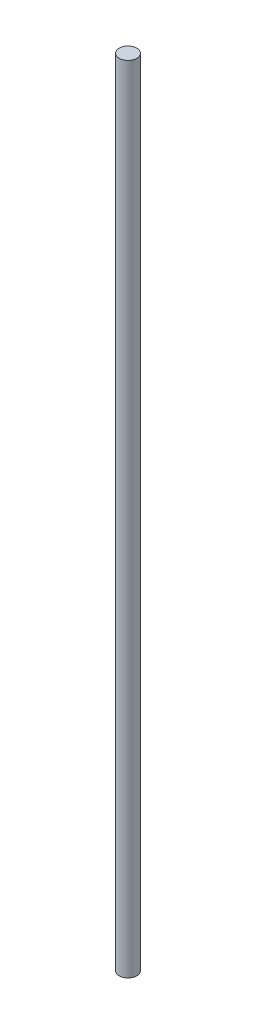
ISO-10303-21;
HEADER;
FILE_DESCRIPTION(('STEP AP214'),'2;1');
FILE_NAME('part.step','',(''),(''),'','','');
FILE_SCHEMA(('AUTOMOTIVE_DESIGN { 1 0 10303 214 1 1 1 1 }'));
ENDSEC;
DATA;
#1=APPLICATION_CONTEXT('core data for automotive mechanical design processes');
#2=APPLICATION_PROTOCOL_DEFINITION('international standard','automotive_design',2000,#1);
#3=PRODUCT_CONTEXT('',#1,'mechanical');
#4=PRODUCT('Part','Part','',(#3));
#5=PRODUCT_RELATED_PRODUCT_CATEGORY('part','',(#4));
#6=PRODUCT_DEFINITION_FORMATION('','',#4);
#7=PRODUCT_DEFINITION_CONTEXT('part definition',#1,'design');
#8=PRODUCT_DEFINITION('design','',#6,#7);
#9=PRODUCT_DEFINITION_SHAPE('','',#8);
#10=(LENGTH_UNIT() NAMED_UNIT(*) SI_UNIT(.MILLI.,.METRE.));
#11=(NAMED_UNIT(*) PLANE_ANGLE_UNIT() SI_UNIT($,.RADIAN.));
#12=(NAMED_UNIT(*) SI_UNIT($,.STERADIAN.) SOLID_ANGLE_UNIT());
#13=UNCERTAINTY_MEASURE_WITH_UNIT(LENGTH_MEASURE(1.E-05),#10,'distance_accuracy_value','');
#14=(GEOMETRIC_REPRESENTATION_CONTEXT(3) GLOBAL_UNCERTAINTY_ASSIGNED_CONTEXT((#13)) GLOBAL_UNIT_ASSIGNED_CONTEXT((#10,
#11,#12)) REPRESENTATION_CONTEXT('',''));
#15=CARTESIAN_POINT('',(0.,0.,0.));
#16=DIRECTION('',(0.,0.,1.));
#17=DIRECTION('',(1.,0.,0.));
#18=AXIS2_PLACEMENT_3D('',#15,#16,#17);
#19=CARTESIAN_POINT('',(0.,360.,0.));
#20=DIRECTION('',(0.,-1.,0.));
#21=DIRECTION('',(0.,0.,-1.));
#22=AXIS2_PLACEMENT_3D('',#19,#20,#21);
#23=CYLINDRICAL_SURFACE('',#22,4.);
#24=CARTESIAN_POINT('',(0.,360.,0.));
#25=DIRECTION('',(0.,1.,0.));
#26=DIRECTION('',(0.,0.,1.));
#27=AXIS2_PLACEMENT_3D('',#24,#25,#26);
#28=CIRCLE('',#27,4.);
#29=CARTESIAN_POINT('',(0.,360.,4.));
#30=VERTEX_POINT('',#29);
#31=EDGE_CURVE('E10',#30,#30,#28,.T.);
#32=ORIENTED_EDGE('',*,*,#31,.F.);
#33=EDGE_LOOP('',(#32));
#34=FACE_BOUND('',#33,.T.);
#35=CARTESIAN_POINT('',(0.,0.,0.));
#36=DIRECTION('',(0.,1.,0.));
#37=DIRECTION('',(0.,0.,1.));
#38=AXIS2_PLACEMENT_3D('',#35,#36,#37);
#39=CIRCLE('',#38,4.);
#40=CARTESIAN_POINT('',(0.,0.,4.));
#41=VERTEX_POINT('',#40);
#42=EDGE_CURVE('E38',#41,#41,#39,.T.);
#43=ORIENTED_EDGE('',*,*,#42,.T.);
#44=EDGE_LOOP('',(#43));
#45=FACE_BOUND('',#44,.T.);
#46=ADVANCED_FACE('F35',(#34,#45),#23,.T.);
#47=CARTESIAN_POINT('',(0.,360.,0.));
#48=DIRECTION('',(0.,1.,0.));
#49=DIRECTION('',(0.,0.,1.));
#50=AXIS2_PLACEMENT_3D('',#47,#48,#49);
#51=PLANE('',#50);
#52=ORIENTED_EDGE('',*,*,#31,.T.);
#53=EDGE_LOOP('',(#52));
#54=FACE_BOUND('',#53,.T.);
#55=ADVANCED_FACE('F50',(#54),#51,.T.);
#56=CARTESIAN_POINT('',(0.,0.,0.));
#57=DIRECTION('',(0.,1.,0.));
#58=DIRECTION('',(0.,0.,1.));
#59=AXIS2_PLACEMENT_3D('',#56,#57,#58);
#60=PLANE('',#59);
#61=ORIENTED_EDGE('',*,*,#42,.F.);
#62=EDGE_LOOP('',(#61));
#63=FACE_BOUND('',#62,.T.);
#64=ADVANCED_FACE('F48',(#63),#60,.F.);
#65=CLOSED_SHELL('',(#46,#55,#64));
#66=MANIFOLD_SOLID_BREP('B2',#65);
#67=ADVANCED_BREP_SHAPE_REPRESENTATION('',(#18,#66),#14);
#68=SHAPE_DEFINITION_REPRESENTATION(#9,#67);
ENDSEC;
END-ISO-10303-21;
